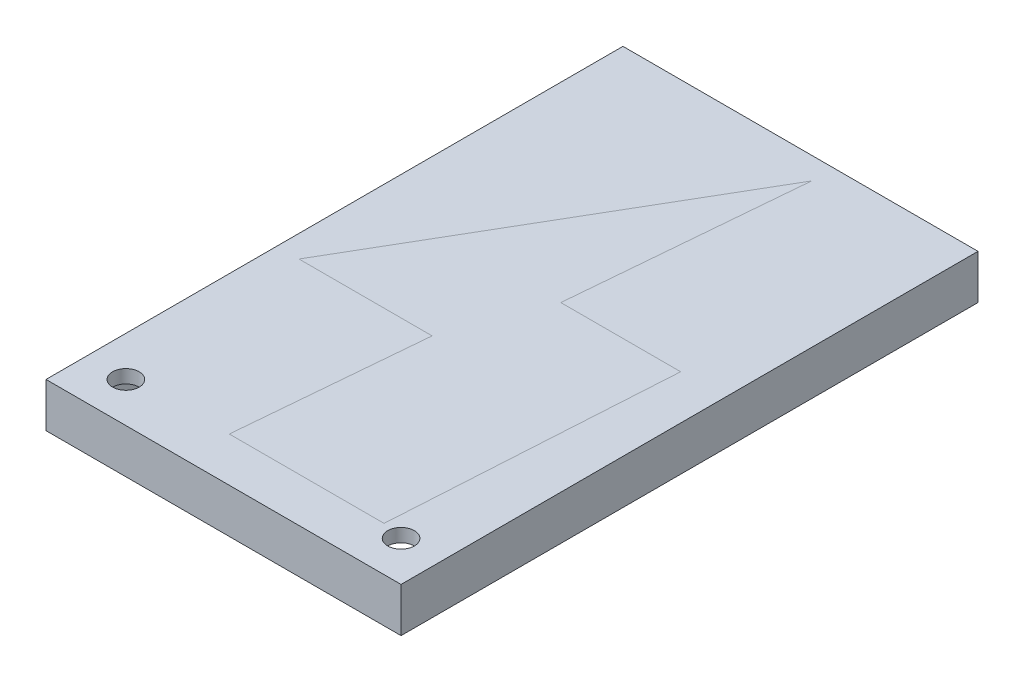
ISO-10303-21;
HEADER;
FILE_DESCRIPTION(('STEP AP214'),'2;1');
FILE_NAME('part.step','',(''),(''),'','','');
FILE_SCHEMA(('AUTOMOTIVE_DESIGN { 1 0 10303 214 1 1 1 1 }'));
ENDSEC;
DATA;
#1=APPLICATION_CONTEXT('core data for automotive mechanical design processes');
#2=APPLICATION_PROTOCOL_DEFINITION('international standard','automotive_design',2000,#1);
#3=PRODUCT_CONTEXT('',#1,'mechanical');
#4=PRODUCT('Part','Part','',(#3));
#5=PRODUCT_RELATED_PRODUCT_CATEGORY('part','',(#4));
#6=PRODUCT_DEFINITION_FORMATION('','',#4);
#7=PRODUCT_DEFINITION_CONTEXT('part definition',#1,'design');
#8=PRODUCT_DEFINITION('design','',#6,#7);
#9=PRODUCT_DEFINITION_SHAPE('','',#8);
#10=(LENGTH_UNIT() NAMED_UNIT(*) SI_UNIT(.MILLI.,.METRE.));
#11=(NAMED_UNIT(*) PLANE_ANGLE_UNIT() SI_UNIT($,.RADIAN.));
#12=(NAMED_UNIT(*) SI_UNIT($,.STERADIAN.) SOLID_ANGLE_UNIT());
#13=UNCERTAINTY_MEASURE_WITH_UNIT(LENGTH_MEASURE(1.E-05),#10,'distance_accuracy_value','');
#14=(GEOMETRIC_REPRESENTATION_CONTEXT(3) GLOBAL_UNCERTAINTY_ASSIGNED_CONTEXT((#13)) GLOBAL_UNIT_ASSIGNED_CONTEXT((#10,
#11,#12)) REPRESENTATION_CONTEXT('',''));
#15=CARTESIAN_POINT('',(0.,0.,0.));
#16=DIRECTION('',(0.,0.,1.));
#17=DIRECTION('',(1.,0.,0.));
#18=AXIS2_PLACEMENT_3D('',#15,#16,#17);
#19=CARTESIAN_POINT('',(-8.83099910139004,2.,115.));
#20=DIRECTION('',(0.998156213661525,0.,0.0606973898029268));
#21=DIRECTION('',(0.0606973898029268,0.,-0.998156213661525));
#22=AXIS2_PLACEMENT_3D('',#19,#20,#21);
#23=PLANE('',#22);
#24=DIRECTION('',(0.0606973898029268,0.,-0.998156213661525));
#25=VECTOR('',#24,1.);
#26=CARTESIAN_POINT('',(-8.83099910139004,3.,115.));
#27=LINE('',#26,#25);
#28=CARTESIAN_POINT('',(-8.83099910139004,3.,115.));
#29=VERTEX_POINT('',#28);
#30=CARTESIAN_POINT('',(-4.9999999999998,3.,52.));
#31=VERTEX_POINT('',#30);
#32=EDGE_CURVE('E136',#29,#31,#27,.T.);
#33=ORIENTED_EDGE('',*,*,#32,.F.);
#34=DIRECTION('',(0.,1.,0.));
#35=VECTOR('',#34,1.);
#36=CARTESIAN_POINT('',(-8.83099910139004,2.,115.));
#37=LINE('',#36,#35);
#38=CARTESIAN_POINT('',(-8.83099910139004,2.,115.));
#39=VERTEX_POINT('',#38);
#40=EDGE_CURVE('E12',#39,#29,#37,.T.);
#41=ORIENTED_EDGE('',*,*,#40,.F.);
#42=DIRECTION('',(0.0606973898029268,0.,-0.998156213661525));
#43=VECTOR('',#42,1.);
#44=CARTESIAN_POINT('',(-8.83099910139004,2.,115.));
#45=LINE('',#44,#43);
#46=CARTESIAN_POINT('',(-4.9999999999998,2.,52.));
#47=VERTEX_POINT('',#46);
#48=EDGE_CURVE('E153',#39,#47,#45,.T.);
#49=ORIENTED_EDGE('',*,*,#48,.T.);
#50=DIRECTION('',(0.,1.,0.));
#51=VECTOR('',#50,1.);
#52=CARTESIAN_POINT('',(-4.9999999999998,2.,52.));
#53=LINE('',#52,#51);
#54=EDGE_CURVE('E48',#47,#31,#53,.T.);
#55=ORIENTED_EDGE('',*,*,#54,.T.);
#56=EDGE_LOOP('',(#33,#41,#49,#55));
#57=FACE_BOUND('',#56,.T.);
#58=ADVANCED_FACE('F45',(#57),#23,.T.);
#59=CARTESIAN_POINT('',(-43.6995304013899,2.,115.));
#60=DIRECTION('',(0.,0.,1.));
#61=DIRECTION('',(1.,0.,0.));
#62=AXIS2_PLACEMENT_3D('',#59,#60,#61);
#63=PLANE('',#62);
#64=DIRECTION('',(1.,0.,0.));
#65=VECTOR('',#64,1.);
#66=CARTESIAN_POINT('',(-43.6995304013899,3.,115.));
#67=LINE('',#66,#65);
#68=CARTESIAN_POINT('',(-43.6995304013899,3.,115.));
#69=VERTEX_POINT('',#68);
#70=EDGE_CURVE('E151',#69,#29,#67,.T.);
#71=ORIENTED_EDGE('',*,*,#70,.F.);
#72=DIRECTION('',(0.,1.,0.));
#73=VECTOR('',#72,1.);
#74=CARTESIAN_POINT('',(-43.6995304013899,2.,115.));
#75=LINE('',#74,#73);
#76=CARTESIAN_POINT('',(-43.6995304013899,2.,115.));
#77=VERTEX_POINT('',#76);
#78=EDGE_CURVE('E54',#77,#69,#75,.T.);
#79=ORIENTED_EDGE('',*,*,#78,.F.);
#80=DIRECTION('',(1.,0.,0.));
#81=VECTOR('',#80,1.);
#82=CARTESIAN_POINT('',(-43.6995304013899,2.,115.));
#83=LINE('',#82,#81);
#84=EDGE_CURVE('E126',#77,#39,#83,.T.);
#85=ORIENTED_EDGE('',*,*,#84,.T.);
#86=ORIENTED_EDGE('',*,*,#40,.T.);
#87=EDGE_LOOP('',(#71,#79,#85,#86));
#88=FACE_BOUND('',#87,.T.);
#89=ADVANCED_FACE('F163',(#88),#63,.T.);
#90=CARTESIAN_POINT('',(-40.,2.,73.));
#91=DIRECTION('',(-0.996143029082855,0.,-0.087744319529158));
#92=DIRECTION('',(-0.087744319529158,0.,0.996143029082855));
#93=AXIS2_PLACEMENT_3D('',#90,#91,#92);
#94=PLANE('',#93);
#95=DIRECTION('',(-0.087744319529158,0.,0.996143029082855));
#96=VECTOR('',#95,1.);
#97=CARTESIAN_POINT('',(-40.,3.,73.));
#98=LINE('',#97,#96);
#99=CARTESIAN_POINT('',(-40.,3.,73.));
#100=VERTEX_POINT('',#99);
#101=EDGE_CURVE('E113',#100,#69,#98,.T.);
#102=ORIENTED_EDGE('',*,*,#101,.F.);
#103=DIRECTION('',(0.,1.,0.));
#104=VECTOR('',#103,1.);
#105=CARTESIAN_POINT('',(-40.,2.,73.));
#106=LINE('',#105,#104);
#107=CARTESIAN_POINT('',(-40.,2.,73.));
#108=VERTEX_POINT('',#107);
#109=EDGE_CURVE('E108',#108,#100,#106,.T.);
#110=ORIENTED_EDGE('',*,*,#109,.F.);
#111=DIRECTION('',(-0.087744319529158,0.,0.996143029082855));
#112=VECTOR('',#111,1.);
#113=CARTESIAN_POINT('',(-40.,2.,73.));
#114=LINE('',#113,#112);
#115=EDGE_CURVE('E111',#108,#77,#114,.T.);
#116=ORIENTED_EDGE('',*,*,#115,.T.);
#117=ORIENTED_EDGE('',*,*,#78,.T.);
#118=EDGE_LOOP('',(#102,#110,#116,#117));
#119=FACE_BOUND('',#118,.T.);
#120=ADVANCED_FACE('F110',(#119),#94,.T.);
#121=CARTESIAN_POINT('',(-70.,2.,73.));
#122=DIRECTION('',(0.,0.,1.));
#123=DIRECTION('',(1.,0.,0.));
#124=AXIS2_PLACEMENT_3D('',#121,#122,#123);
#125=PLANE('',#124);
#126=DIRECTION('',(1.,0.,0.));
#127=VECTOR('',#126,1.);
#128=CARTESIAN_POINT('',(-70.,3.,73.));
#129=LINE('',#128,#127);
#130=CARTESIAN_POINT('',(-70.,3.,73.));
#131=VERTEX_POINT('',#130);
#132=EDGE_CURVE('E148',#131,#100,#129,.T.);
#133=ORIENTED_EDGE('',*,*,#132,.F.);
#134=DIRECTION('',(0.,1.,0.));
#135=VECTOR('',#134,1.);
#136=CARTESIAN_POINT('',(-70.,2.,73.));
#137=LINE('',#136,#135);
#138=CARTESIAN_POINT('',(-70.,2.,73.));
#139=VERTEX_POINT('',#138);
#140=EDGE_CURVE('E118',#139,#131,#137,.T.);
#141=ORIENTED_EDGE('',*,*,#140,.F.);
#142=DIRECTION('',(1.,0.,0.));
#143=VECTOR('',#142,1.);
#144=CARTESIAN_POINT('',(-70.,2.,73.));
#145=LINE('',#144,#143);
#146=EDGE_CURVE('E124',#139,#108,#145,.T.);
#147=ORIENTED_EDGE('',*,*,#146,.T.);
#148=ORIENTED_EDGE('',*,*,#109,.T.);
#149=EDGE_LOOP('',(#133,#141,#147,#148));
#150=FACE_BOUND('',#149,.T.);
#151=ADVANCED_FACE('F128',(#150),#125,.T.);
#152=CARTESIAN_POINT('',(-27.4764430142712,2.,0.));
#153=DIRECTION('',(-0.864086693543947,0.,-0.503343010322274));
#154=DIRECTION('',(-0.503343010322274,0.,0.864086693543947));
#155=AXIS2_PLACEMENT_3D('',#152,#153,#154);
#156=PLANE('',#155);
#157=DIRECTION('',(-0.503343010322274,0.,0.864086693543947));
#158=VECTOR('',#157,1.);
#159=CARTESIAN_POINT('',(-27.4764430142712,3.,0.));
#160=LINE('',#159,#158);
#161=CARTESIAN_POINT('',(-27.4764430142712,3.,0.));
#162=VERTEX_POINT('',#161);
#163=EDGE_CURVE('E145',#162,#131,#160,.T.);
#164=ORIENTED_EDGE('',*,*,#163,.F.);
#165=DIRECTION('',(0.,1.,0.));
#166=VECTOR('',#165,1.);
#167=CARTESIAN_POINT('',(-27.4764430142712,2.,0.));
#168=LINE('',#167,#166);
#169=CARTESIAN_POINT('',(-27.4764430142712,2.,0.));
#170=VERTEX_POINT('',#169);
#171=EDGE_CURVE('E157',#170,#162,#168,.T.);
#172=ORIENTED_EDGE('',*,*,#171,.F.);
#173=DIRECTION('',(-0.503343010322274,0.,0.864086693543947));
#174=VECTOR('',#173,1.);
#175=CARTESIAN_POINT('',(-27.4764430142712,2.,0.));
#176=LINE('',#175,#174);
#177=EDGE_CURVE('E129',#170,#139,#176,.T.);
#178=ORIENTED_EDGE('',*,*,#177,.T.);
#179=ORIENTED_EDGE('',*,*,#140,.T.);
#180=EDGE_LOOP('',(#164,#172,#178,#179));
#181=FACE_BOUND('',#180,.T.);
#182=ADVANCED_FACE('F176',(#181),#156,.T.);
#183=CARTESIAN_POINT('',(-32.,2.,52.));
#184=DIRECTION('',(0.996237581869191,0.,0.0866641821713455));
#185=DIRECTION('',(0.0866641821713455,0.,-0.996237581869191));
#186=AXIS2_PLACEMENT_3D('',#183,#184,#185);
#187=PLANE('',#186);
#188=DIRECTION('',(0.0866641821713455,0.,-0.99623758186919));
#189=VECTOR('',#188,1.);
#190=CARTESIAN_POINT('',(-32.,3.,52.));
#191=LINE('',#190,#189);
#192=CARTESIAN_POINT('',(-32.,3.,52.));
#193=VERTEX_POINT('',#192);
#194=EDGE_CURVE('E142',#193,#162,#191,.T.);
#195=ORIENTED_EDGE('',*,*,#194,.F.);
#196=DIRECTION('',(0.,1.,0.));
#197=VECTOR('',#196,1.);
#198=CARTESIAN_POINT('',(-32.,2.,52.));
#199=LINE('',#198,#197);
#200=CARTESIAN_POINT('',(-32.,2.,52.));
#201=VERTEX_POINT('',#200);
#202=EDGE_CURVE('E158',#201,#193,#199,.T.);
#203=ORIENTED_EDGE('',*,*,#202,.F.);
#204=DIRECTION('',(0.0866641821713455,0.,-0.99623758186919));
#205=VECTOR('',#204,1.);
#206=CARTESIAN_POINT('',(-32.,2.,52.));
#207=LINE('',#206,#205);
#208=EDGE_CURVE('E131',#201,#170,#207,.T.);
#209=ORIENTED_EDGE('',*,*,#208,.T.);
#210=ORIENTED_EDGE('',*,*,#171,.T.);
#211=EDGE_LOOP('',(#195,#203,#209,#210));
#212=FACE_BOUND('',#211,.T.);
#213=ADVANCED_FACE('F179',(#212),#187,.T.);
#214=CARTESIAN_POINT('',(-4.9999999999998,2.,52.));
#215=DIRECTION('',(0.,0.,-1.));
#216=DIRECTION('',(-1.,0.,0.));
#217=AXIS2_PLACEMENT_3D('',#214,#215,#216);
#218=PLANE('',#217);
#219=DIRECTION('',(-1.,0.,0.));
#220=VECTOR('',#219,1.);
#221=CARTESIAN_POINT('',(-4.9999999999998,3.,52.));
#222=LINE('',#221,#220);
#223=EDGE_CURVE('E139',#31,#193,#222,.T.);
#224=ORIENTED_EDGE('',*,*,#223,.F.);
#225=ORIENTED_EDGE('',*,*,#54,.F.);
#226=DIRECTION('',(-1.,0.,0.));
#227=VECTOR('',#226,1.);
#228=CARTESIAN_POINT('',(-4.9999999999998,2.,52.));
#229=LINE('',#228,#227);
#230=EDGE_CURVE('E241',#47,#201,#229,.T.);
#231=ORIENTED_EDGE('',*,*,#230,.T.);
#232=ORIENTED_EDGE('',*,*,#202,.T.);
#233=EDGE_LOOP('',(#224,#225,#231,#232));
#234=FACE_BOUND('',#233,.T.);
#235=ADVANCED_FACE('F160',(#234),#218,.T.);
#236=CARTESIAN_POINT('',(0.,2.,0.));
#237=DIRECTION('',(0.,1.,0.));
#238=DIRECTION('',(0.,0.,1.));
#239=AXIS2_PLACEMENT_3D('',#236,#237,#238);
#240=PLANE('',#239);
#241=ORIENTED_EDGE('',*,*,#48,.F.);
#242=ORIENTED_EDGE('',*,*,#84,.F.);
#243=ORIENTED_EDGE('',*,*,#115,.F.);
#244=ORIENTED_EDGE('',*,*,#146,.F.);
#245=ORIENTED_EDGE('',*,*,#177,.F.);
#246=ORIENTED_EDGE('',*,*,#208,.F.);
#247=ORIENTED_EDGE('',*,*,#230,.F.);
#248=EDGE_LOOP('',(#241,#242,#243,#244,#245,#246,#247));
#249=FACE_BOUND('',#248,.T.);
#250=ADVANCED_FACE('F122',(#249),#240,.F.);
#251=CARTESIAN_POINT('',(0.,3.,0.));
#252=DIRECTION('',(0.,1.,0.));
#253=DIRECTION('',(0.,0.,1.));
#254=AXIS2_PLACEMENT_3D('',#251,#252,#253);
#255=PLANE('',#254);
#256=ORIENTED_EDGE('',*,*,#32,.T.);
#257=ORIENTED_EDGE('',*,*,#223,.T.);
#258=ORIENTED_EDGE('',*,*,#194,.T.);
#259=ORIENTED_EDGE('',*,*,#163,.T.);
#260=ORIENTED_EDGE('',*,*,#132,.T.);
#261=ORIENTED_EDGE('',*,*,#101,.T.);
#262=ORIENTED_EDGE('',*,*,#70,.T.);
#263=EDGE_LOOP('',(#256,#257,#258,#259,#260,#261,#262));
#264=FACE_BOUND('',#263,.T.);
#265=ADVANCED_FACE('F162',(#264),#255,.T.);
#266=CLOSED_SHELL('',(#58,#89,#120,#151,#182,#213,#235,#250,#265));
#267=MANIFOLD_SOLID_BREP('B2',#266);
#268=CARTESIAN_POINT('',(0.,0.,0.));
#269=DIRECTION('',(0.,-1.,0.));
#270=DIRECTION('',(0.,0.,-1.));
#271=AXIS2_PLACEMENT_3D('',#268,#269,#270);
#272=PLANE('',#271);
#273=CARTESIAN_POINT('',(-66.,0.,116.));
#274=DIRECTION('',(0.,-1.,0.));
#275=DIRECTION('',(0.,0.,-1.));
#276=AXIS2_PLACEMENT_3D('',#273,#274,#275);
#277=CIRCLE('',#276,2.99999999999998);
#278=CARTESIAN_POINT('',(-66.,0.,113.));
#279=VERTEX_POINT('',#278);
#280=EDGE_CURVE('E652',#279,#279,#277,.T.);
#281=ORIENTED_EDGE('',*,*,#280,.F.);
#282=EDGE_LOOP('',(#281));
#283=FACE_BOUND('',#282,.T.);
#284=CARTESIAN_POINT('',(-3.99999999999999,0.,116.));
#285=DIRECTION('',(0.,-1.,0.));
#286=DIRECTION('',(0.,0.,-1.));
#287=AXIS2_PLACEMENT_3D('',#284,#285,#286);
#288=CIRCLE('',#287,2.99999999999998);
#289=CARTESIAN_POINT('',(-3.99999999999999,0.,113.));
#290=VERTEX_POINT('',#289);
#291=EDGE_CURVE('E441',#290,#290,#288,.T.);
#292=ORIENTED_EDGE('',*,*,#291,.F.);
#293=EDGE_LOOP('',(#292));
#294=FACE_BOUND('',#293,.T.);
#295=DIRECTION('',(-0.0877443195291579,0.,0.996143029082855));
#296=VECTOR('',#295,1.);
#297=CARTESIAN_POINT('',(-33.3114072420516,0.,-2.93420390012021));
#298=LINE('',#297,#296);
#299=CARTESIAN_POINT('',(-43.6995304013899,0.,115.));
#300=VERTEX_POINT('',#299);
#301=CARTESIAN_POINT('',(-40.,0.,73.));
#302=VERTEX_POINT('',#301);
#303=EDGE_CURVE('E43',#300,#302,#298,.F.);
#304=ORIENTED_EDGE('',*,*,#303,.F.);
#305=DIRECTION('',(-1.,0.,0.));
#306=VECTOR('',#305,1.);
#307=CARTESIAN_POINT('',(0.,0.,115.));
#308=LINE('',#307,#306);
#309=CARTESIAN_POINT('',(-8.83099910139004,0.,115.));
#310=VERTEX_POINT('',#309);
#311=EDGE_CURVE('E288',#310,#300,#308,.T.);
#312=ORIENTED_EDGE('',*,*,#311,.F.);
#313=DIRECTION('',(0.0606973898029268,0.,-0.998156213661525));
#314=VECTOR('',#313,1.);
#315=CARTESIAN_POINT('',(-1.83113434154435,0.,-0.111350381221924));
#316=LINE('',#315,#314);
#317=CARTESIAN_POINT('',(-4.9999999999998,0.,52.));
#318=VERTEX_POINT('',#317);
#319=EDGE_CURVE('E428',#318,#310,#316,.F.);
#320=ORIENTED_EDGE('',*,*,#319,.F.);
#321=DIRECTION('',(1.,0.,0.));
#322=VECTOR('',#321,1.);
#323=CARTESIAN_POINT('',(0.,0.,52.));
#324=LINE('',#323,#322);
#325=CARTESIAN_POINT('',(-32.,0.,52.));
#326=VERTEX_POINT('',#325);
#327=EDGE_CURVE('E279',#326,#318,#324,.T.);
#328=ORIENTED_EDGE('',*,*,#327,.F.);
#329=DIRECTION('',(-0.0866641821713455,0.,0.996237581869191));
#330=VECTOR('',#329,1.);
#331=CARTESIAN_POINT('',(-27.2700762302996,0.,-2.37226430447941));
#332=LINE('',#331,#330);
#333=CARTESIAN_POINT('',(-27.4764430142712,0.,0.));
#334=VERTEX_POINT('',#333);
#335=EDGE_CURVE('E430',#334,#326,#332,.T.);
#336=ORIENTED_EDGE('',*,*,#335,.F.);
#337=DIRECTION('',(1.,0.,0.));
#338=VECTOR('',#337,1.);
#339=CARTESIAN_POINT('',(-70.,0.,0.));
#340=LINE('',#339,#338);
#341=CARTESIAN_POINT('',(0.,0.,0.));
#342=VERTEX_POINT('',#341);
#343=EDGE_CURVE('E460',#334,#342,#340,.T.);
#344=ORIENTED_EDGE('',*,*,#343,.T.);
#345=DIRECTION('',(0.,0.,1.));
#346=VECTOR('',#345,1.);
#347=CARTESIAN_POINT('',(0.,0.,0.));
#348=LINE('',#347,#346);
#349=CARTESIAN_POINT('',(0.,0.,120.));
#350=VERTEX_POINT('',#349);
#351=EDGE_CURVE('E462',#342,#350,#348,.T.);
#352=ORIENTED_EDGE('',*,*,#351,.T.);
#353=DIRECTION('',(-1.,0.,0.));
#354=VECTOR('',#353,1.);
#355=CARTESIAN_POINT('',(0.,0.,120.));
#356=LINE('',#355,#354);
#357=CARTESIAN_POINT('',(-70.,0.,120.));
#358=VERTEX_POINT('',#357);
#359=EDGE_CURVE('E377',#350,#358,#356,.T.);
#360=ORIENTED_EDGE('',*,*,#359,.T.);
#361=DIRECTION('',(0.,0.,-1.));
#362=VECTOR('',#361,1.);
#363=CARTESIAN_POINT('',(-70.,0.,120.));
#364=LINE('',#363,#362);
#365=CARTESIAN_POINT('',(-70.,0.,73.));
#366=VERTEX_POINT('',#365);
#367=EDGE_CURVE('E457',#358,#366,#364,.T.);
#368=ORIENTED_EDGE('',*,*,#367,.T.);
#369=DIRECTION('',(-1.,0.,0.));
#370=VECTOR('',#369,1.);
#371=CARTESIAN_POINT('',(0.,0.,73.));
#372=LINE('',#371,#370);
#373=EDGE_CURVE('E256',#302,#366,#372,.T.);
#374=ORIENTED_EDGE('',*,*,#373,.F.);
#375=EDGE_LOOP('',(#304,#312,#320,#328,#336,#344,#352,#360,#368,#374));
#376=FACE_BOUND('',#375,.T.);
#377=ADVANCED_FACE('F246',(#283,#294,#376),#272,.T.);
#378=CARTESIAN_POINT('',(-75.,3.,125.));
#379=DIRECTION('',(-1.,0.,0.));
#380=DIRECTION('',(0.,0.,1.));
#381=AXIS2_PLACEMENT_3D('',#378,#379,#380);
#382=PLANE('',#381);
#383=DIRECTION('',(0.,0.,-1.));
#384=VECTOR('',#383,1.);
#385=CARTESIAN_POINT('',(-75.,-7.,125.));
#386=LINE('',#385,#384);
#387=CARTESIAN_POINT('',(-75.,-7.,125.));
#388=VERTEX_POINT('',#387);
#389=CARTESIAN_POINT('',(-75.,-7.,-5.));
#390=VERTEX_POINT('',#389);
#391=EDGE_CURVE('E392',#388,#390,#386,.T.);
#392=ORIENTED_EDGE('',*,*,#391,.F.);
#393=DIRECTION('',(0.,-1.,0.));
#394=VECTOR('',#393,1.);
#395=CARTESIAN_POINT('',(-75.,3.,125.));
#396=LINE('',#395,#394);
#397=CARTESIAN_POINT('',(-75.,3.,125.));
#398=VERTEX_POINT('',#397);
#399=EDGE_CURVE('E420',#398,#388,#396,.T.);
#400=ORIENTED_EDGE('',*,*,#399,.F.);
#401=DIRECTION('',(0.,0.,-1.));
#402=VECTOR('',#401,1.);
#403=CARTESIAN_POINT('',(-75.,3.,125.));
#404=LINE('',#403,#402);
#405=CARTESIAN_POINT('',(-75.,3.,-5.));
#406=VERTEX_POINT('',#405);
#407=EDGE_CURVE('E396',#398,#406,#404,.T.);
#408=ORIENTED_EDGE('',*,*,#407,.T.);
#409=DIRECTION('',(0.,-1.,0.));
#410=VECTOR('',#409,1.);
#411=CARTESIAN_POINT('',(-75.,3.,-5.));
#412=LINE('',#411,#410);
#413=EDGE_CURVE('E409',#406,#390,#412,.T.);
#414=ORIENTED_EDGE('',*,*,#413,.T.);
#415=EDGE_LOOP('',(#392,#400,#408,#414));
#416=FACE_BOUND('',#415,.T.);
#417=ADVANCED_FACE('F501',(#416),#382,.T.);
#418=CARTESIAN_POINT('',(5.,3.,125.));
#419=DIRECTION('',(0.,0.,1.));
#420=DIRECTION('',(1.,0.,0.));
#421=AXIS2_PLACEMENT_3D('',#418,#419,#420);
#422=PLANE('',#421);
#423=DIRECTION('',(-1.,0.,0.));
#424=VECTOR('',#423,1.);
#425=CARTESIAN_POINT('',(5.,-7.,125.));
#426=LINE('',#425,#424);
#427=CARTESIAN_POINT('',(5.,-7.,125.));
#428=VERTEX_POINT('',#427);
#429=EDGE_CURVE('E400',#428,#388,#426,.T.);
#430=ORIENTED_EDGE('',*,*,#429,.F.);
#431=DIRECTION('',(0.,-1.,0.));
#432=VECTOR('',#431,1.);
#433=CARTESIAN_POINT('',(5.,3.,125.));
#434=LINE('',#433,#432);
#435=CARTESIAN_POINT('',(5.,3.,125.));
#436=VERTEX_POINT('',#435);
#437=EDGE_CURVE('E422',#436,#428,#434,.T.);
#438=ORIENTED_EDGE('',*,*,#437,.F.);
#439=DIRECTION('',(-1.,0.,0.));
#440=VECTOR('',#439,1.);
#441=CARTESIAN_POINT('',(5.,3.,125.));
#442=LINE('',#441,#440);
#443=EDGE_CURVE('E406',#436,#398,#442,.T.);
#444=ORIENTED_EDGE('',*,*,#443,.T.);
#445=ORIENTED_EDGE('',*,*,#399,.T.);
#446=EDGE_LOOP('',(#430,#438,#444,#445));
#447=FACE_BOUND('',#446,.T.);
#448=ADVANCED_FACE('F507',(#447),#422,.T.);
#449=CARTESIAN_POINT('',(5.,3.,-5.));
#450=DIRECTION('',(1.,0.,0.));
#451=DIRECTION('',(0.,0.,-1.));
#452=AXIS2_PLACEMENT_3D('',#449,#450,#451);
#453=PLANE('',#452);
#454=DIRECTION('',(0.,0.,1.));
#455=VECTOR('',#454,1.);
#456=CARTESIAN_POINT('',(5.,-7.,-5.));
#457=LINE('',#456,#455);
#458=CARTESIAN_POINT('',(5.,-7.,-5.));
#459=VERTEX_POINT('',#458);
#460=EDGE_CURVE('E415',#459,#428,#457,.T.);
#461=ORIENTED_EDGE('',*,*,#460,.F.);
#462=DIRECTION('',(0.,-1.,0.));
#463=VECTOR('',#462,1.);
#464=CARTESIAN_POINT('',(5.,3.,-5.));
#465=LINE('',#464,#463);
#466=CARTESIAN_POINT('',(5.,3.,-5.));
#467=VERTEX_POINT('',#466);
#468=EDGE_CURVE('E424',#467,#459,#465,.T.);
#469=ORIENTED_EDGE('',*,*,#468,.F.);
#470=DIRECTION('',(0.,0.,1.));
#471=VECTOR('',#470,1.);
#472=CARTESIAN_POINT('',(5.,3.,-5.));
#473=LINE('',#472,#471);
#474=EDGE_CURVE('E403',#467,#436,#473,.T.);
#475=ORIENTED_EDGE('',*,*,#474,.T.);
#476=ORIENTED_EDGE('',*,*,#437,.T.);
#477=EDGE_LOOP('',(#461,#469,#475,#476));
#478=FACE_BOUND('',#477,.T.);
#479=ADVANCED_FACE('F529',(#478),#453,.T.);
#480=CARTESIAN_POINT('',(-75.,3.,-5.));
#481=DIRECTION('',(0.,0.,-1.));
#482=DIRECTION('',(-1.,0.,0.));
#483=AXIS2_PLACEMENT_3D('',#480,#481,#482);
#484=PLANE('',#483);
#485=DIRECTION('',(1.,0.,0.));
#486=VECTOR('',#485,1.);
#487=CARTESIAN_POINT('',(-75.,-7.,-5.));
#488=LINE('',#487,#486);
#489=EDGE_CURVE('E412',#390,#459,#488,.T.);
#490=ORIENTED_EDGE('',*,*,#489,.F.);
#491=ORIENTED_EDGE('',*,*,#413,.F.);
#492=DIRECTION('',(1.,0.,0.));
#493=VECTOR('',#492,1.);
#494=CARTESIAN_POINT('',(-75.,3.,-5.));
#495=LINE('',#494,#493);
#496=EDGE_CURVE('E399',#406,#467,#495,.T.);
#497=ORIENTED_EDGE('',*,*,#496,.T.);
#498=ORIENTED_EDGE('',*,*,#468,.T.);
#499=EDGE_LOOP('',(#490,#491,#497,#498));
#500=FACE_BOUND('',#499,.T.);
#501=ADVANCED_FACE('F525',(#500),#484,.T.);
#502=CARTESIAN_POINT('',(0.,3.,0.));
#503=DIRECTION('',(0.,-1.,0.));
#504=DIRECTION('',(0.,0.,-1.));
#505=AXIS2_PLACEMENT_3D('',#502,#503,#504);
#506=PLANE('',#505);
#507=CARTESIAN_POINT('',(-66.,3.,116.));
#508=DIRECTION('',(0.,1.,0.));
#509=DIRECTION('',(0.,0.,1.));
#510=AXIS2_PLACEMENT_3D('',#507,#508,#509);
#511=CIRCLE('',#510,2.99999999999998);
#512=CARTESIAN_POINT('',(-66.,3.,119.));
#513=VERTEX_POINT('',#512);
#514=EDGE_CURVE('E654',#513,#513,#511,.T.);
#515=ORIENTED_EDGE('',*,*,#514,.F.);
#516=EDGE_LOOP('',(#515));
#517=FACE_BOUND('',#516,.T.);
#518=CARTESIAN_POINT('',(-3.99999999999999,3.,116.));
#519=DIRECTION('',(0.,1.,0.));
#520=DIRECTION('',(0.,0.,1.));
#521=AXIS2_PLACEMENT_3D('',#518,#519,#520);
#522=CIRCLE('',#521,2.99999999999998);
#523=CARTESIAN_POINT('',(-3.99999999999999,3.,119.));
#524=VERTEX_POINT('',#523);
#525=EDGE_CURVE('E649',#524,#524,#522,.T.);
#526=ORIENTED_EDGE('',*,*,#525,.F.);
#527=EDGE_LOOP('',(#526));
#528=FACE_BOUND('',#527,.T.);
#529=DIRECTION('',(1.,0.,0.));
#530=VECTOR('',#529,1.);
#531=CARTESIAN_POINT('',(-40.,3.,115.));
#532=LINE('',#531,#530);
#533=CARTESIAN_POINT('',(-43.6995304013899,3.,115.));
#534=VERTEX_POINT('',#533);
#535=CARTESIAN_POINT('',(-8.83099910139004,3.,115.));
#536=VERTEX_POINT('',#535);
#537=EDGE_CURVE('E440',#534,#536,#532,.T.);
#538=ORIENTED_EDGE('',*,*,#537,.F.);
#539=DIRECTION('',(0.0877443195291579,0.,-0.996143029082855));
#540=VECTOR('',#539,1.);
#541=CARTESIAN_POINT('',(-40.,3.,73.));
#542=LINE('',#541,#540);
#543=CARTESIAN_POINT('',(-40.,3.,73.));
#544=VERTEX_POINT('',#543);
#545=EDGE_CURVE('E265',#544,#534,#542,.F.);
#546=ORIENTED_EDGE('',*,*,#545,.F.);
#547=DIRECTION('',(1.,0.,0.));
#548=VECTOR('',#547,1.);
#549=CARTESIAN_POINT('',(-70.,3.,73.));
#550=LINE('',#549,#548);
#551=CARTESIAN_POINT('',(-70.,3.,73.));
#552=VERTEX_POINT('',#551);
#553=EDGE_CURVE('E438',#552,#544,#550,.T.);
#554=ORIENTED_EDGE('',*,*,#553,.F.);
#555=DIRECTION('',(-0.503343010322274,0.,0.864086693543947));
#556=VECTOR('',#555,1.);
#557=CARTESIAN_POINT('',(-27.4764430142712,3.,0.));
#558=LINE('',#557,#556);
#559=CARTESIAN_POINT('',(-27.4764430142712,3.,0.));
#560=VERTEX_POINT('',#559);
#561=EDGE_CURVE('E641',#560,#552,#558,.T.);
#562=ORIENTED_EDGE('',*,*,#561,.F.);
#563=DIRECTION('',(0.0866641821713455,0.,-0.99623758186919));
#564=VECTOR('',#563,1.);
#565=CARTESIAN_POINT('',(-32.,3.,52.));
#566=LINE('',#565,#564);
#567=CARTESIAN_POINT('',(-32.,3.,52.));
#568=VERTEX_POINT('',#567);
#569=EDGE_CURVE('E487',#568,#560,#566,.T.);
#570=ORIENTED_EDGE('',*,*,#569,.F.);
#571=DIRECTION('',(-1.,0.,0.));
#572=VECTOR('',#571,1.);
#573=CARTESIAN_POINT('',(-8.83099910139004,3.,52.));
#574=LINE('',#573,#572);
#575=CARTESIAN_POINT('',(-4.9999999999998,3.,52.));
#576=VERTEX_POINT('',#575);
#577=EDGE_CURVE('E644',#576,#568,#574,.T.);
#578=ORIENTED_EDGE('',*,*,#577,.F.);
#579=DIRECTION('',(-0.0606973898029268,0.,0.998156213661525));
#580=VECTOR('',#579,1.);
#581=CARTESIAN_POINT('',(-8.83099910139004,3.,115.));
#582=LINE('',#581,#580);
#583=EDGE_CURVE('E250',#536,#576,#582,.F.);
#584=ORIENTED_EDGE('',*,*,#583,.F.);
#585=EDGE_LOOP('',(#538,#546,#554,#562,#570,#578,#584));
#586=FACE_BOUND('',#585,.T.);
#587=ORIENTED_EDGE('',*,*,#407,.F.);
#588=ORIENTED_EDGE('',*,*,#443,.F.);
#589=ORIENTED_EDGE('',*,*,#474,.F.);
#590=ORIENTED_EDGE('',*,*,#496,.F.);
#591=EDGE_LOOP('',(#587,#588,#589,#590));
#592=FACE_BOUND('',#591,.T.);
#593=ADVANCED_FACE('F528',(#517,#528,#586,#592),#506,.F.);
#594=CARTESIAN_POINT('',(0.,-7.,0.));
#595=DIRECTION('',(0.,-1.,0.));
#596=DIRECTION('',(0.,0.,-1.));
#597=AXIS2_PLACEMENT_3D('',#594,#595,#596);
#598=PLANE('',#597);
#599=DIRECTION('',(0.,0.,-1.));
#600=VECTOR('',#599,1.);
#601=CARTESIAN_POINT('',(-70.,-7.,120.));
#602=LINE('',#601,#600);
#603=CARTESIAN_POINT('',(-70.,-7.,120.));
#604=VERTEX_POINT('',#603);
#605=CARTESIAN_POINT('',(-70.,-7.,0.));
#606=VERTEX_POINT('',#605);
#607=EDGE_CURVE('E355',#604,#606,#602,.T.);
#608=ORIENTED_EDGE('',*,*,#607,.F.);
#609=DIRECTION('',(-1.,0.,0.));
#610=VECTOR('',#609,1.);
#611=CARTESIAN_POINT('',(0.,-7.,120.));
#612=LINE('',#611,#610);
#613=CARTESIAN_POINT('',(0.,-7.,120.));
#614=VERTEX_POINT('',#613);
#615=EDGE_CURVE('E385',#614,#604,#612,.T.);
#616=ORIENTED_EDGE('',*,*,#615,.F.);
#617=DIRECTION('',(0.,0.,1.));
#618=VECTOR('',#617,1.);
#619=CARTESIAN_POINT('',(0.,-7.,0.));
#620=LINE('',#619,#618);
#621=CARTESIAN_POINT('',(0.,-7.,0.));
#622=VERTEX_POINT('',#621);
#623=EDGE_CURVE('E383',#622,#614,#620,.T.);
#624=ORIENTED_EDGE('',*,*,#623,.F.);
#625=DIRECTION('',(1.,0.,0.));
#626=VECTOR('',#625,1.);
#627=CARTESIAN_POINT('',(-70.,-7.,0.));
#628=LINE('',#627,#626);
#629=EDGE_CURVE('E367',#606,#622,#628,.T.);
#630=ORIENTED_EDGE('',*,*,#629,.F.);
#631=EDGE_LOOP('',(#608,#616,#624,#630));
#632=FACE_BOUND('',#631,.T.);
#633=ORIENTED_EDGE('',*,*,#391,.T.);
#634=ORIENTED_EDGE('',*,*,#489,.T.);
#635=ORIENTED_EDGE('',*,*,#460,.T.);
#636=ORIENTED_EDGE('',*,*,#429,.T.);
#637=EDGE_LOOP('',(#633,#634,#635,#636));
#638=FACE_BOUND('',#637,.T.);
#639=ADVANCED_FACE('F380',(#632,#638),#598,.T.);
#640=CARTESIAN_POINT('',(-70.,0.,120.));
#641=DIRECTION('',(-1.,0.,0.));
#642=DIRECTION('',(0.,0.,1.));
#643=AXIS2_PLACEMENT_3D('',#640,#641,#642);
#644=PLANE('',#643);
#645=CARTESIAN_POINT('',(-70.,0.,0.));
#646=VERTEX_POINT('',#645);
#647=EDGE_CURVE('E390',#366,#646,#364,.T.);
#648=ORIENTED_EDGE('',*,*,#647,.F.);
#649=ORIENTED_EDGE('',*,*,#367,.F.);
#650=DIRECTION('',(0.,-1.,0.));
#651=VECTOR('',#650,1.);
#652=CARTESIAN_POINT('',(-70.,0.,120.));
#653=LINE('',#652,#651);
#654=EDGE_CURVE('E362',#358,#604,#653,.T.);
#655=ORIENTED_EDGE('',*,*,#654,.T.);
#656=ORIENTED_EDGE('',*,*,#607,.T.);
#657=DIRECTION('',(0.,-1.,0.));
#658=VECTOR('',#657,1.);
#659=CARTESIAN_POINT('',(-70.,0.,0.));
#660=LINE('',#659,#658);
#661=EDGE_CURVE('E359',#646,#606,#660,.T.);
#662=ORIENTED_EDGE('',*,*,#661,.F.);
#663=EDGE_LOOP('',(#648,#649,#655,#656,#662));
#664=FACE_BOUND('',#663,.T.);
#665=ADVANCED_FACE('F358',(#664),#644,.F.);
#666=CARTESIAN_POINT('',(0.,0.,120.));
#667=DIRECTION('',(0.,0.,1.));
#668=DIRECTION('',(1.,0.,0.));
#669=AXIS2_PLACEMENT_3D('',#666,#667,#668);
#670=PLANE('',#669);
#671=ORIENTED_EDGE('',*,*,#615,.T.);
#672=ORIENTED_EDGE('',*,*,#654,.F.);
#673=ORIENTED_EDGE('',*,*,#359,.F.);
#674=DIRECTION('',(0.,-1.,0.));
#675=VECTOR('',#674,1.);
#676=CARTESIAN_POINT('',(0.,0.,120.));
#677=LINE('',#676,#675);
#678=EDGE_CURVE('E393',#350,#614,#677,.T.);
#679=ORIENTED_EDGE('',*,*,#678,.T.);
#680=EDGE_LOOP('',(#671,#672,#673,#679));
#681=FACE_BOUND('',#680,.T.);
#682=ADVANCED_FACE('F471',(#681),#670,.F.);
#683=CARTESIAN_POINT('',(0.,0.,0.));
#684=DIRECTION('',(1.,0.,0.));
#685=DIRECTION('',(0.,0.,-1.));
#686=AXIS2_PLACEMENT_3D('',#683,#684,#685);
#687=PLANE('',#686);
#688=ORIENTED_EDGE('',*,*,#623,.T.);
#689=ORIENTED_EDGE('',*,*,#678,.F.);
#690=ORIENTED_EDGE('',*,*,#351,.F.);
#691=DIRECTION('',(0.,-1.,0.));
#692=VECTOR('',#691,1.);
#693=CARTESIAN_POINT('',(0.,0.,0.));
#694=LINE('',#693,#692);
#695=EDGE_CURVE('E376',#342,#622,#694,.T.);
#696=ORIENTED_EDGE('',*,*,#695,.T.);
#697=EDGE_LOOP('',(#688,#689,#690,#696));
#698=FACE_BOUND('',#697,.T.);
#699=ADVANCED_FACE('F491',(#698),#687,.F.);
#700=CARTESIAN_POINT('',(-70.,0.,0.));
#701=DIRECTION('',(0.,0.,-1.));
#702=DIRECTION('',(-1.,0.,0.));
#703=AXIS2_PLACEMENT_3D('',#700,#701,#702);
#704=PLANE('',#703);
#705=ORIENTED_EDGE('',*,*,#343,.F.);
#706=EDGE_CURVE('E375',#646,#334,#340,.T.);
#707=ORIENTED_EDGE('',*,*,#706,.F.);
#708=ORIENTED_EDGE('',*,*,#661,.T.);
#709=ORIENTED_EDGE('',*,*,#629,.T.);
#710=ORIENTED_EDGE('',*,*,#695,.F.);
#711=EDGE_LOOP('',(#705,#707,#708,#709,#710));
#712=FACE_BOUND('',#711,.T.);
#713=ADVANCED_FACE('F371',(#712),#704,.F.);
#714=DIRECTION('',(0.503343010322274,0.,-0.864086693543947));
#715=VECTOR('',#714,1.);
#716=CARTESIAN_POINT('',(-20.5151711591081,0.,-11.9503842446071));
#717=LINE('',#716,#715);
#718=EDGE_CURVE('E432',#366,#334,#717,.T.);
#719=ORIENTED_EDGE('',*,*,#718,.F.);
#720=ORIENTED_EDGE('',*,*,#647,.T.);
#721=ORIENTED_EDGE('',*,*,#706,.T.);
#722=EDGE_LOOP('',(#719,#720,#721));
#723=FACE_BOUND('',#722,.T.);
#724=ADVANCED_FACE('F474',(#723),#272,.T.);
#725=CARTESIAN_POINT('',(-40.,-7.,73.));
#726=DIRECTION('',(0.996143029082855,0.,0.0877443195291579));
#727=DIRECTION('',(0.0877443195291579,0.,-0.996143029082855));
#728=AXIS2_PLACEMENT_3D('',#725,#726,#727);
#729=PLANE('',#728);
#730=ORIENTED_EDGE('',*,*,#303,.T.);
#731=DIRECTION('',(0.,1.,0.));
#732=VECTOR('',#731,1.);
#733=CARTESIAN_POINT('',(-40.,-7.,73.));
#734=LINE('',#733,#732);
#735=EDGE_CURVE('E292',#302,#544,#734,.T.);
#736=ORIENTED_EDGE('',*,*,#735,.T.);
#737=ORIENTED_EDGE('',*,*,#545,.T.);
#738=DIRECTION('',(0.,-1.,0.));
#739=VECTOR('',#738,1.);
#740=CARTESIAN_POINT('',(-43.6995304013899,-7.,115.));
#741=LINE('',#740,#739);
#742=EDGE_CURVE('E435',#300,#534,#741,.F.);
#743=ORIENTED_EDGE('',*,*,#742,.F.);
#744=EDGE_LOOP('',(#730,#736,#737,#743));
#745=FACE_BOUND('',#744,.T.);
#746=ADVANCED_FACE('F514',(#745),#729,.T.);
#747=CARTESIAN_POINT('',(-70.,-7.,73.));
#748=DIRECTION('',(0.,0.,1.));
#749=DIRECTION('',(1.,0.,0.));
#750=AXIS2_PLACEMENT_3D('',#747,#748,#749);
#751=PLANE('',#750);
#752=ORIENTED_EDGE('',*,*,#373,.T.);
#753=DIRECTION('',(0.,1.,0.));
#754=VECTOR('',#753,1.);
#755=CARTESIAN_POINT('',(-70.,-7.,73.));
#756=LINE('',#755,#754);
#757=EDGE_CURVE('E482',#366,#552,#756,.T.);
#758=ORIENTED_EDGE('',*,*,#757,.T.);
#759=ORIENTED_EDGE('',*,*,#553,.T.);
#760=ORIENTED_EDGE('',*,*,#735,.F.);
#761=EDGE_LOOP('',(#752,#758,#759,#760));
#762=FACE_BOUND('',#761,.T.);
#763=ADVANCED_FACE('F518',(#762),#751,.F.);
#764=CARTESIAN_POINT('',(-27.4764430142712,-7.,0.));
#765=DIRECTION('',(-0.864086693543947,0.,-0.503343010322274));
#766=DIRECTION('',(-0.503343010322274,0.,0.864086693543947));
#767=AXIS2_PLACEMENT_3D('',#764,#765,#766);
#768=PLANE('',#767);
#769=ORIENTED_EDGE('',*,*,#718,.T.);
#770=DIRECTION('',(0.,1.,0.));
#771=VECTOR('',#770,1.);
#772=CARTESIAN_POINT('',(-27.4764430142712,-7.,0.));
#773=LINE('',#772,#771);
#774=EDGE_CURVE('E448',#334,#560,#773,.T.);
#775=ORIENTED_EDGE('',*,*,#774,.T.);
#776=ORIENTED_EDGE('',*,*,#561,.T.);
#777=ORIENTED_EDGE('',*,*,#757,.F.);
#778=EDGE_LOOP('',(#769,#775,#776,#777));
#779=FACE_BOUND('',#778,.T.);
#780=ADVANCED_FACE('F479',(#779),#768,.F.);
#781=CARTESIAN_POINT('',(-32.,-7.,52.));
#782=DIRECTION('',(0.996237581869191,0.,0.0866641821713455));
#783=DIRECTION('',(0.0866641821713455,0.,-0.996237581869191));
#784=AXIS2_PLACEMENT_3D('',#781,#782,#783);
#785=PLANE('',#784);
#786=ORIENTED_EDGE('',*,*,#335,.T.);
#787=DIRECTION('',(0.,1.,0.));
#788=VECTOR('',#787,1.);
#789=CARTESIAN_POINT('',(-32.,-7.,52.));
#790=LINE('',#789,#788);
#791=EDGE_CURVE('E444',#326,#568,#790,.T.);
#792=ORIENTED_EDGE('',*,*,#791,.T.);
#793=ORIENTED_EDGE('',*,*,#569,.T.);
#794=ORIENTED_EDGE('',*,*,#774,.F.);
#795=EDGE_LOOP('',(#786,#792,#793,#794));
#796=FACE_BOUND('',#795,.T.);
#797=ADVANCED_FACE('F485',(#796),#785,.F.);
#798=CARTESIAN_POINT('',(-8.83099910139004,-7.,52.));
#799=DIRECTION('',(0.,0.,-1.));
#800=DIRECTION('',(-1.,0.,0.));
#801=AXIS2_PLACEMENT_3D('',#798,#799,#800);
#802=PLANE('',#801);
#803=ORIENTED_EDGE('',*,*,#327,.T.);
#804=DIRECTION('',(0.,-1.,0.));
#805=VECTOR('',#804,1.);
#806=CARTESIAN_POINT('',(-4.9999999999998,-7.,52.));
#807=LINE('',#806,#805);
#808=EDGE_CURVE('E443',#318,#576,#807,.F.);
#809=ORIENTED_EDGE('',*,*,#808,.T.);
#810=ORIENTED_EDGE('',*,*,#577,.T.);
#811=ORIENTED_EDGE('',*,*,#791,.F.);
#812=EDGE_LOOP('',(#803,#809,#810,#811));
#813=FACE_BOUND('',#812,.T.);
#814=ADVANCED_FACE('F630',(#813),#802,.F.);
#815=CARTESIAN_POINT('',(-8.83099910139004,-7.,115.));
#816=DIRECTION('',(-0.998156213661525,0.,-0.0606973898029268));
#817=DIRECTION('',(-0.0606973898029268,0.,0.998156213661525));
#818=AXIS2_PLACEMENT_3D('',#815,#816,#817);
#819=PLANE('',#818);
#820=ORIENTED_EDGE('',*,*,#319,.T.);
#821=DIRECTION('',(0.,1.,0.));
#822=VECTOR('',#821,1.);
#823=CARTESIAN_POINT('',(-8.83099910139004,-7.,115.));
#824=LINE('',#823,#822);
#825=EDGE_CURVE('E437',#310,#536,#824,.T.);
#826=ORIENTED_EDGE('',*,*,#825,.T.);
#827=ORIENTED_EDGE('',*,*,#583,.T.);
#828=ORIENTED_EDGE('',*,*,#808,.F.);
#829=EDGE_LOOP('',(#820,#826,#827,#828));
#830=FACE_BOUND('',#829,.T.);
#831=ADVANCED_FACE('F248',(#830),#819,.T.);
#832=CARTESIAN_POINT('',(-40.,-7.,115.));
#833=DIRECTION('',(0.,0.,1.));
#834=DIRECTION('',(1.,0.,0.));
#835=AXIS2_PLACEMENT_3D('',#832,#833,#834);
#836=PLANE('',#835);
#837=ORIENTED_EDGE('',*,*,#311,.T.);
#838=ORIENTED_EDGE('',*,*,#742,.T.);
#839=ORIENTED_EDGE('',*,*,#537,.T.);
#840=ORIENTED_EDGE('',*,*,#825,.F.);
#841=EDGE_LOOP('',(#837,#838,#839,#840));
#842=FACE_BOUND('',#841,.T.);
#843=ADVANCED_FACE('F607',(#842),#836,.F.);
#844=CARTESIAN_POINT('',(-3.99999999999999,3.,116.));
#845=DIRECTION('',(0.,1.,0.));
#846=DIRECTION('',(0.,0.,1.));
#847=AXIS2_PLACEMENT_3D('',#844,#845,#846);
#848=CYLINDRICAL_SURFACE('',#847,2.99999999999998);
#849=ORIENTED_EDGE('',*,*,#291,.T.);
#850=EDGE_LOOP('',(#849));
#851=FACE_BOUND('',#850,.T.);
#852=ORIENTED_EDGE('',*,*,#525,.T.);
#853=EDGE_LOOP('',(#852));
#854=FACE_BOUND('',#853,.T.);
#855=ADVANCED_FACE('F601',(#851,#854),#848,.F.);
#856=CARTESIAN_POINT('',(-66.,3.,116.));
#857=DIRECTION('',(0.,1.,0.));
#858=DIRECTION('',(0.,0.,1.));
#859=AXIS2_PLACEMENT_3D('',#856,#857,#858);
#860=CYLINDRICAL_SURFACE('',#859,2.99999999999998);
#861=ORIENTED_EDGE('',*,*,#280,.T.);
#862=EDGE_LOOP('',(#861));
#863=FACE_BOUND('',#862,.T.);
#864=ORIENTED_EDGE('',*,*,#514,.T.);
#865=EDGE_LOOP('',(#864));
#866=FACE_BOUND('',#865,.T.);
#867=ADVANCED_FACE('F606',(#863,#866),#860,.F.);
#868=CLOSED_SHELL('',(#377,#417,#448,#479,#501,#593,#639,#665,#682,#699,#713,#724,#746,#763,
#780,#797,#814,#831,#843,#855,#867));
#869=MANIFOLD_SOLID_BREP('B6',#868);
#870=ADVANCED_BREP_SHAPE_REPRESENTATION('',(#18,#267,#869),#14);
#871=SHAPE_DEFINITION_REPRESENTATION(#9,#870);
ENDSEC;
END-ISO-10303-21;
